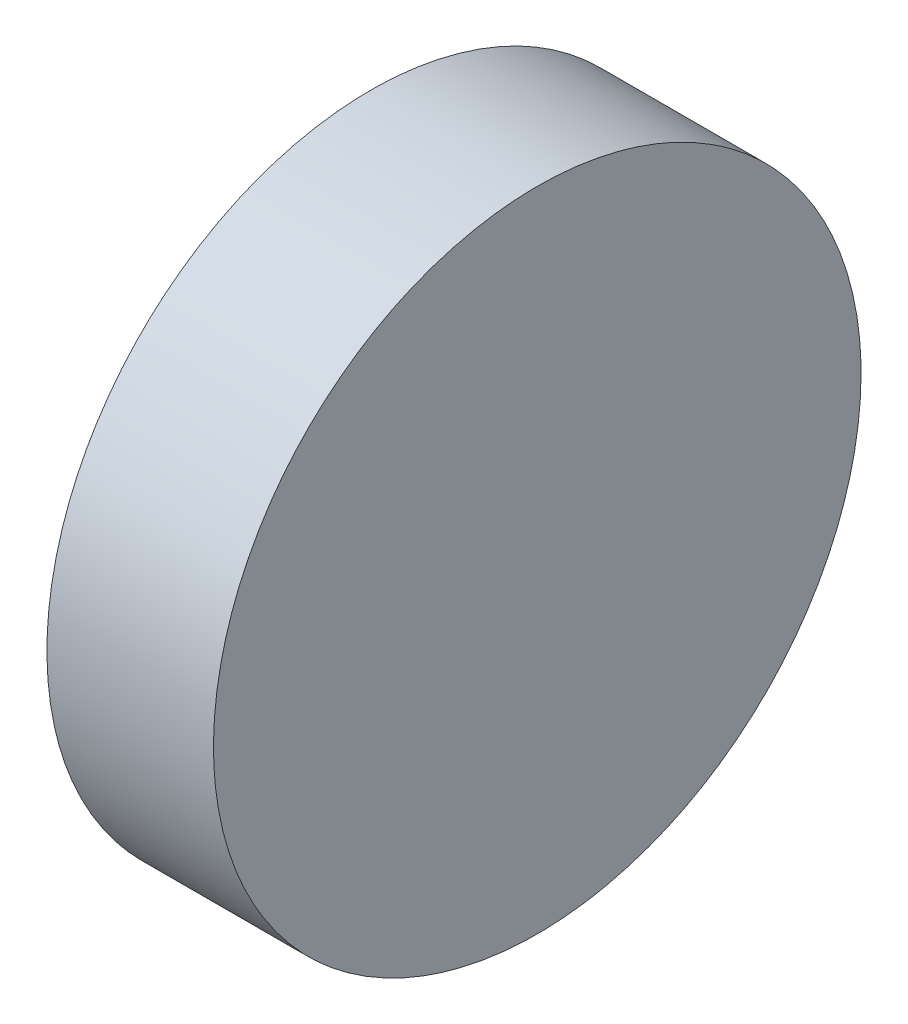
ISO-10303-21;
HEADER;
FILE_DESCRIPTION(('STEP AP214'),'2;1');
FILE_NAME('part.step','',(''),(''),'','','');
FILE_SCHEMA(('AUTOMOTIVE_DESIGN { 1 0 10303 214 1 1 1 1 }'));
ENDSEC;
DATA;
#1=APPLICATION_CONTEXT('core data for automotive mechanical design processes');
#2=APPLICATION_PROTOCOL_DEFINITION('international standard','automotive_design',2000,#1);
#3=PRODUCT_CONTEXT('',#1,'mechanical');
#4=PRODUCT('Part','Part','',(#3));
#5=PRODUCT_RELATED_PRODUCT_CATEGORY('part','',(#4));
#6=PRODUCT_DEFINITION_FORMATION('','',#4);
#7=PRODUCT_DEFINITION_CONTEXT('part definition',#1,'design');
#8=PRODUCT_DEFINITION('design','',#6,#7);
#9=PRODUCT_DEFINITION_SHAPE('','',#8);
#10=(LENGTH_UNIT() NAMED_UNIT(*) SI_UNIT(.MILLI.,.METRE.));
#11=(NAMED_UNIT(*) PLANE_ANGLE_UNIT() SI_UNIT($,.RADIAN.));
#12=(NAMED_UNIT(*) SI_UNIT($,.STERADIAN.) SOLID_ANGLE_UNIT());
#13=UNCERTAINTY_MEASURE_WITH_UNIT(LENGTH_MEASURE(1.E-05),#10,'distance_accuracy_value','');
#14=(GEOMETRIC_REPRESENTATION_CONTEXT(3) GLOBAL_UNCERTAINTY_ASSIGNED_CONTEXT((#13)) GLOBAL_UNIT_ASSIGNED_CONTEXT((#10,
#11,#12)) REPRESENTATION_CONTEXT('',''));
#15=CARTESIAN_POINT('',(0.,0.,0.));
#16=DIRECTION('',(0.,0.,1.));
#17=DIRECTION('',(1.,0.,0.));
#18=AXIS2_PLACEMENT_3D('',#15,#16,#17);
#19=CARTESIAN_POINT('',(24.3378726721836,36.,14.7146446609407));
#20=CARTESIAN_POINT('',(24.3378726721836,36.1682299792076,14.7146446609407));
#21=CARTESIAN_POINT('',(24.3378726721836,36.5046899376229,14.7815707077975));
#22=CARTESIAN_POINT('',(24.3378726721836,36.9325454072684,15.0674545927316));
#23=CARTESIAN_POINT('',(24.3378726721836,37.2184292922025,15.4953100623771));
#24=CARTESIAN_POINT('',(24.3378726721836,37.3188183624877,16.));
#25=CARTESIAN_POINT('',(24.3378726721836,37.2184292922025,16.5046899376229));
#26=CARTESIAN_POINT('',(24.3378726721836,36.9325454072684,16.9325454072684));
#27=CARTESIAN_POINT('',(24.3378726721836,36.5046899376229,17.2184292922025));
#28=CARTESIAN_POINT('',(24.3378726721836,36.,17.3188183624878));
#29=CARTESIAN_POINT('',(24.3378726721836,35.4953100623771,17.2184292922025));
#30=CARTESIAN_POINT('',(24.3378726721836,35.0674545927316,16.9325454072684));
#31=CARTESIAN_POINT('',(24.3378726721836,34.7815707077975,16.5046899376229));
#32=CARTESIAN_POINT('',(24.3378726721836,34.6811816375123,16.));
#33=CARTESIAN_POINT('',(24.3378726721836,34.7815707077975,15.4953100623771));
#34=CARTESIAN_POINT('',(24.3378726721836,35.0674545927316,15.0674545927316));
#35=CARTESIAN_POINT('',(24.3378726721836,35.4953100623771,14.7815707077975));
#36=CARTESIAN_POINT('',(24.3378726721836,35.8317700207924,14.7146446609407));
#37=CARTESIAN_POINT('',(24.3378726721836,36.,14.7146446609407));
#38=B_SPLINE_CURVE_WITH_KNOTS('',3,(#19,#20,#21,#22,#23,#24,#25,#26,#27,#28,#29,#30,#31,#32,#33,
#34,#35,#36,#37),.UNSPECIFIED.,.T.,.F.,(4,1,1,1,1,1,1,1,1,1,1,1,1,1,1,1,4),(0.,
0.0624999999999997,0.125,0.1875,0.25,0.3125,0.375,0.4375,0.5,0.5625,0.625,0.6875,0.75,0.8125,
0.875,0.9375,1.),.UNSPECIFIED.);
#39=DIRECTION('',(1.,0.,0.));
#40=VECTOR('',#39,1.);
#41=SURFACE_OF_LINEAR_EXTRUSION('',#38,#40);
#42=CARTESIAN_POINT('',(24.3378726721836,36.,14.7146446609407));
#43=CARTESIAN_POINT('',(24.3378726721836,36.0197921706209,14.7146446470269));
#44=CARTESIAN_POINT('',(24.3378726721836,36.0395839935619,14.7151078346916));
#45=CARTESIAN_POINT('',(24.3378726721836,36.0791259388407,14.7169521775189));
#46=CARTESIAN_POINT('',(24.3378726721836,36.0988760588795,14.718333382031));
#47=CARTESIAN_POINT('',(24.3378726721836,36.138292752249,14.7220054418346));
#48=CARTESIAN_POINT('',(24.3378726721836,36.1579593199991,14.7242963569526));
#49=CARTESIAN_POINT('',(24.3378726721836,36.1971673059562,14.7297795414951));
#50=CARTESIAN_POINT('',(24.3378726721836,36.2167087182843,14.7329718529476));
#51=CARTESIAN_POINT('',(24.3378726721836,36.2556247161304,14.7402495765758));
#52=CARTESIAN_POINT('',(24.3378726721836,36.2749992999462,14.744334997853));
#53=CARTESIAN_POINT('',(24.3378726721836,36.3135399912098,14.7533906635596));
#54=CARTESIAN_POINT('',(24.3378726721836,36.3327061048341,14.7583608816989));
#55=CARTESIAN_POINT('',(24.3378726721836,36.3707881375572,14.7691780063327));
#56=CARTESIAN_POINT('',(24.3378726721836,36.3897040714076,14.7750248608846));
#57=CARTESIAN_POINT('',(24.3378726721836,36.4272442489715,14.7875865909455));
#58=CARTESIAN_POINT('',(24.3378726721836,36.4458685114274,14.7943014104212));
#59=CARTESIAN_POINT('',(24.3378726721836,36.4827830263011,14.8085923322341));
#60=CARTESIAN_POINT('',(24.3378726721836,36.5010732893006,14.8161684072297));
#61=CARTESIAN_POINT('',(24.3378726721836,36.5372810008054,14.83216570329));
#62=CARTESIAN_POINT('',(24.3378726721836,36.5551984374598,14.8405869511704));
#63=CARTESIAN_POINT('',(24.3378726721836,36.5906258361186,14.8582493808133));
#64=CARTESIAN_POINT('',(24.3378726721836,36.6081357717545,14.8674906154502));
#65=CARTESIAN_POINT('',(24.3378726721836,36.6427126974179,14.8867698167363));
#66=CARTESIAN_POINT('',(24.3378726721836,36.6597796611473,14.8968078305452));
#67=CARTESIAN_POINT('',(24.3378726721836,36.6934353682858,14.9176568924794));
#68=CARTESIAN_POINT('',(24.3378726721836,36.7100240974723,14.928467963562));
#69=CARTESIAN_POINT('',(24.3378726721836,36.7426879898128,14.9508396002413));
#70=CARTESIAN_POINT('',(24.3378726721836,36.7587631581988,14.9624001581987));
#71=CARTESIAN_POINT('',(24.3378726721836,36.7903645930021,14.9862471998143));
#72=CARTESIAN_POINT('',(24.3378726721836,36.8058908849802,14.9985336495967));
#73=CARTESIAN_POINT('',(24.3378726721836,36.8363592155701,15.0238089005846));
#74=CARTESIAN_POINT('',(24.3378726721836,36.8513012925416,15.0367976555427));
#75=CARTESIAN_POINT('',(24.3378726721836,36.8805658883065,15.0634539672131));
#76=CARTESIAN_POINT('',(24.3378726721836,36.8948884403631,15.0771214873967));
#77=CARTESIAN_POINT('',(24.3378726721836,36.9228785126033,15.1051115596369));
#78=CARTESIAN_POINT('',(24.3378726721836,36.9365460327869,15.1194341116935));
#79=CARTESIAN_POINT('',(24.3378726721836,36.9632023444573,15.1486987074584));
#80=CARTESIAN_POINT('',(24.3378726721836,36.9761910994154,15.1636407844299));
#81=CARTESIAN_POINT('',(24.3378726721836,37.0014663504033,15.1941091150198));
#82=CARTESIAN_POINT('',(24.3378726721836,37.0137528001857,15.2096354069979));
#83=CARTESIAN_POINT('',(24.3378726721836,37.0375998418013,15.2412368418012));
#84=CARTESIAN_POINT('',(24.3378726721836,37.0491603997587,15.2573120101872));
#85=CARTESIAN_POINT('',(24.3378726721836,37.071532036438,15.2899759025277));
#86=CARTESIAN_POINT('',(24.3378726721836,37.0823431075206,15.3065646317142));
#87=CARTESIAN_POINT('',(24.3378726721836,37.1031921694548,15.3402203388527));
#88=CARTESIAN_POINT('',(24.3378726721836,37.1132301832637,15.357287302582));
#89=CARTESIAN_POINT('',(24.3378726721836,37.1325093845498,15.3918642282457));
#90=CARTESIAN_POINT('',(24.3378726721836,37.1417506191867,15.4093741638818));
#91=CARTESIAN_POINT('',(24.3378726721836,37.1594130488296,15.4448015625399));
#92=CARTESIAN_POINT('',(24.3378726721836,37.1678342967101,15.4627189991932));
#93=CARTESIAN_POINT('',(24.3378726721836,37.1838315927702,15.4989267107008));
#94=CARTESIAN_POINT('',(24.3378726721836,37.1914076677655,15.5172169737043));
#95=CARTESIAN_POINT('',(24.3378726721836,37.2056985895792,15.5541314885673));
#96=CARTESIAN_POINT('',(24.3378726721836,37.2124134090558,15.5727557510086));
#97=CARTESIAN_POINT('',(24.3378726721836,37.224975139114,15.6102959286123));
#98=CARTESIAN_POINT('',(24.3378726721836,37.2308219936622,15.6292118625171));
#99=CARTESIAN_POINT('',(24.3378726721836,37.2416391183063,15.6672938950916));
#100=CARTESIAN_POINT('',(24.3378726721836,37.2466093364596,15.6864600085129));
#101=CARTESIAN_POINT('',(24.3378726721836,37.2556650021278,15.7250007003311));
#102=CARTESIAN_POINT('',(24.3378726721836,37.2597504233525,15.7443752849046));
#103=CARTESIAN_POINT('',(24.3378726721836,37.2670281471242,15.7832912806807));
#104=CARTESIAN_POINT('',(24.3378726721836,37.2702204587727,15.8028326901811));
#105=CARTESIAN_POINT('',(24.3378726721836,37.2757036427797,15.8420406838634));
#106=CARTESIAN_POINT('',(24.3378726721836,37.2779945571663,15.8617072621656));
#107=CARTESIAN_POINT('',(24.3378726721836,37.2816666189681,15.9011239267069));
#108=CARTESIAN_POINT('',(24.3378726721836,37.2830478262096,15.9208740073685));
#109=CARTESIAN_POINT('',(24.3378726721836,37.2848921615801,15.9604160602261));
#110=CARTESIAN_POINT('',(24.3378726721836,37.2853553390593,15.9802080301131));
#111=CARTESIAN_POINT('',(24.3378726721836,37.2853553390593,16.019791969887));
#112=CARTESIAN_POINT('',(24.3378726721836,37.2848921615801,16.0395839397739));
#113=CARTESIAN_POINT('',(24.3378726721836,37.2830478262096,16.0791259926315));
#114=CARTESIAN_POINT('',(24.3378726721836,37.2816666189681,16.0988760732931));
#115=CARTESIAN_POINT('',(24.3378726721836,37.2779945571663,16.1382927378344));
#116=CARTESIAN_POINT('',(24.3378726721836,37.2757036427797,16.1579593161367));
#117=CARTESIAN_POINT('',(24.3378726721836,37.2702204587727,16.1971673098189));
#118=CARTESIAN_POINT('',(24.3378726721836,37.2670281471242,16.2167087193193));
#119=CARTESIAN_POINT('',(24.3378726721836,37.2597504233525,16.2556247150954));
#120=CARTESIAN_POINT('',(24.3378726721836,37.2556650021278,16.2749992996689));
#121=CARTESIAN_POINT('',(24.3378726721836,37.2466093364596,16.3135399914872));
#122=CARTESIAN_POINT('',(24.3378726721836,37.2416391183063,16.3327061049084));
#123=CARTESIAN_POINT('',(24.3378726721836,37.2308219936622,16.3707881374829));
#124=CARTESIAN_POINT('',(24.3378726721836,37.224975139114,16.3897040713877));
#125=CARTESIAN_POINT('',(24.3378726721836,37.2124134090558,16.4272442489914));
#126=CARTESIAN_POINT('',(24.3378726721836,37.2056985895792,16.4458685114328));
#127=CARTESIAN_POINT('',(24.3378726721836,37.1914076677656,16.4827830262958));
#128=CARTESIAN_POINT('',(24.3378726721836,37.1838315927702,16.5010732892992));
#129=CARTESIAN_POINT('',(24.3378726721836,37.1678342967101,16.5372810008068));
#130=CARTESIAN_POINT('',(24.3378726721836,37.1594130488296,16.5551984374601));
#131=CARTESIAN_POINT('',(24.3378726721836,37.1417506191867,16.5906258361182));
#132=CARTESIAN_POINT('',(24.3378726721836,37.1325093845498,16.6081357717544));
#133=CARTESIAN_POINT('',(24.3378726721836,37.1132301832637,16.642712697418));
#134=CARTESIAN_POINT('',(24.3378726721836,37.1031921694548,16.6597796611473));
#135=CARTESIAN_POINT('',(24.3378726721836,37.0823431075206,16.6934353682858));
#136=CARTESIAN_POINT('',(24.3378726721836,37.071532036438,16.7100240974723));
#137=CARTESIAN_POINT('',(24.3378726721836,37.0491603997587,16.7426879898128));
#138=CARTESIAN_POINT('',(24.3378726721836,37.0375998418013,16.7587631581988));
#139=CARTESIAN_POINT('',(24.3378726721836,37.0137528001857,16.7903645930021));
#140=CARTESIAN_POINT('',(24.3378726721836,37.0014663504033,16.8058908849802));
#141=CARTESIAN_POINT('',(24.3378726721836,36.9761910994154,16.8363592155701));
#142=CARTESIAN_POINT('',(24.3378726721836,36.9632023444573,16.8513012925416));
#143=CARTESIAN_POINT('',(24.3378726721836,36.9365460327869,16.8805658883065));
#144=CARTESIAN_POINT('',(24.3378726721836,36.9228785126033,16.8948884403631));
#145=CARTESIAN_POINT('',(24.3378726721836,36.8948884403631,16.9228785126033));
#146=CARTESIAN_POINT('',(24.3378726721836,36.8805658883065,16.9365460327869));
#147=CARTESIAN_POINT('',(24.3378726721836,36.8513012925416,16.9632023444573));
#148=CARTESIAN_POINT('',(24.3378726721836,36.8363592155701,16.9761910994155));
#149=CARTESIAN_POINT('',(24.3378726721836,36.8058908849802,17.0014663504033));
#150=CARTESIAN_POINT('',(24.3378726721836,36.7903645930021,17.0137528001857));
#151=CARTESIAN_POINT('',(24.3378726721836,36.7587631581988,17.0375998418013));
#152=CARTESIAN_POINT('',(24.3378726721836,36.7426879898128,17.0491603997587));
#153=CARTESIAN_POINT('',(24.3378726721836,36.7100240974723,17.071532036438));
#154=CARTESIAN_POINT('',(24.3378726721836,36.6934353682858,17.0823431075206));
#155=CARTESIAN_POINT('',(24.3378726721836,36.6597796611473,17.1031921694548));
#156=CARTESIAN_POINT('',(24.3378726721836,36.642712697418,17.1132301832637));
#157=CARTESIAN_POINT('',(24.3378726721836,36.6081357717544,17.1325093845498));
#158=CARTESIAN_POINT('',(24.3378726721836,36.5906258361182,17.1417506191867));
#159=CARTESIAN_POINT('',(24.3378726721836,36.5551984374601,17.1594130488296));
#160=CARTESIAN_POINT('',(24.3378726721836,36.5372810008068,17.1678342967101));
#161=CARTESIAN_POINT('',(24.3378726721836,36.5010732892992,17.1838315927702));
#162=CARTESIAN_POINT('',(24.3378726721836,36.4827830262957,17.1914076677656));
#163=CARTESIAN_POINT('',(24.3378726721836,36.4458685114327,17.2056985895792));
#164=CARTESIAN_POINT('',(24.3378726721836,36.4272442489914,17.2124134090559));
#165=CARTESIAN_POINT('',(24.3378726721836,36.3897040713877,17.224975139114));
#166=CARTESIAN_POINT('',(24.3378726721836,36.3707881374829,17.2308219936622));
#167=CARTESIAN_POINT('',(24.3378726721836,36.3327061049084,17.2416391183063));
#168=CARTESIAN_POINT('',(24.3378726721836,36.3135399914871,17.2466093364596));
#169=CARTESIAN_POINT('',(24.3378726721836,36.2749992996689,17.2556650021278));
#170=CARTESIAN_POINT('',(24.3378726721836,36.2556247150954,17.2597504233525));
#171=CARTESIAN_POINT('',(24.3378726721836,36.2167087193193,17.2670281471242));
#172=CARTESIAN_POINT('',(24.3378726721836,36.1971673098189,17.2702204587727));
#173=CARTESIAN_POINT('',(24.3378726721836,36.1579593161366,17.2757036427797));
#174=CARTESIAN_POINT('',(24.3378726721836,36.1382927378344,17.2779945571663));
#175=CARTESIAN_POINT('',(24.3378726721836,36.0988760732931,17.2816666189681));
#176=CARTESIAN_POINT('',(24.3378726721836,36.0791259926315,17.2830478262096));
#177=CARTESIAN_POINT('',(24.3378726721836,36.0395839397739,17.2848921615801));
#178=CARTESIAN_POINT('',(24.3378726721836,36.019791969887,17.2853553390593));
#179=CARTESIAN_POINT('',(24.3378726721836,35.980208030113,17.2853553390593));
#180=CARTESIAN_POINT('',(24.3378726721836,35.9604160602261,17.2848921615801));
#181=CARTESIAN_POINT('',(24.3378726721836,35.9208740073685,17.2830478262096));
#182=CARTESIAN_POINT('',(24.3378726721836,35.9011239267069,17.2816666189681));
#183=CARTESIAN_POINT('',(24.3378726721836,35.8617072621656,17.2779945571663));
#184=CARTESIAN_POINT('',(24.3378726721836,35.8420406838634,17.2757036427797));
#185=CARTESIAN_POINT('',(24.3378726721836,35.8028326901811,17.2702204587727));
#186=CARTESIAN_POINT('',(24.3378726721836,35.7832912806807,17.2670281471242));
#187=CARTESIAN_POINT('',(24.3378726721836,35.7443752849046,17.2597504233525));
#188=CARTESIAN_POINT('',(24.3378726721836,35.7250007003311,17.2556650021278));
#189=CARTESIAN_POINT('',(24.3378726721836,35.6864600085129,17.2466093364596));
#190=CARTESIAN_POINT('',(24.3378726721836,35.6672938950916,17.2416391183063));
#191=CARTESIAN_POINT('',(24.3378726721836,35.6292118625171,17.2308219936622));
#192=CARTESIAN_POINT('',(24.3378726721836,35.6102959286123,17.224975139114));
#193=CARTESIAN_POINT('',(24.3378726721836,35.5727557510086,17.2124134090558));
#194=CARTESIAN_POINT('',(24.3378726721836,35.5541314885672,17.2056985895792));
#195=CARTESIAN_POINT('',(24.3378726721836,35.5172169737042,17.1914076677656));
#196=CARTESIAN_POINT('',(24.3378726721836,35.4989267107008,17.1838315927702));
#197=CARTESIAN_POINT('',(24.3378726721836,35.4627189991932,17.1678342967101));
#198=CARTESIAN_POINT('',(24.3378726721836,35.4448015625399,17.1594130488296));
#199=CARTESIAN_POINT('',(24.3378726721836,35.4093741638818,17.1417506191867));
#200=CARTESIAN_POINT('',(24.3378726721836,35.3918642282456,17.1325093845498));
#201=CARTESIAN_POINT('',(24.3378726721836,35.357287302582,17.1132301832637));
#202=CARTESIAN_POINT('',(24.3378726721836,35.3402203388527,17.1031921694548));
#203=CARTESIAN_POINT('',(24.3378726721836,35.3065646317142,17.0823431075206));
#204=CARTESIAN_POINT('',(24.3378726721836,35.2899759025277,17.071532036438));
#205=CARTESIAN_POINT('',(24.3378726721836,35.2573120101872,17.0491603997587));
#206=CARTESIAN_POINT('',(24.3378726721836,35.2412368418012,17.0375998418013));
#207=CARTESIAN_POINT('',(24.3378726721836,35.2096354069979,17.0137528001857));
#208=CARTESIAN_POINT('',(24.3378726721836,35.1941091150198,17.0014663504033));
#209=CARTESIAN_POINT('',(24.3378726721836,35.1636407844299,16.9761910994155));
#210=CARTESIAN_POINT('',(24.3378726721836,35.1486987074584,16.9632023444573));
#211=CARTESIAN_POINT('',(24.3378726721836,35.1194341116935,16.9365460327869));
#212=CARTESIAN_POINT('',(24.3378726721836,35.1051115596369,16.9228785126033));
#213=CARTESIAN_POINT('',(24.3378726721836,35.0771214873967,16.8948884403631));
#214=CARTESIAN_POINT('',(24.3378726721836,35.0634539672131,16.8805658883065));
#215=CARTESIAN_POINT('',(24.3378726721836,35.0367976555427,16.8513012925416));
#216=CARTESIAN_POINT('',(24.3378726721836,35.0238089005845,16.8363592155701));
#217=CARTESIAN_POINT('',(24.3378726721836,34.9985336495967,16.8058908849802));
#218=CARTESIAN_POINT('',(24.3378726721836,34.9862471998143,16.7903645930021));
#219=CARTESIAN_POINT('',(24.3378726721836,34.9624001581987,16.7587631581988));
#220=CARTESIAN_POINT('',(24.3378726721836,34.9508396002413,16.7426879898128));
#221=CARTESIAN_POINT('',(24.3378726721836,34.928467963562,16.7100240974723));
#222=CARTESIAN_POINT('',(24.3378726721836,34.9176568924794,16.6934353682858));
#223=CARTESIAN_POINT('',(24.3378726721836,34.8968078305452,16.6597796611473));
#224=CARTESIAN_POINT('',(24.3378726721836,34.8867698167363,16.642712697418));
#225=CARTESIAN_POINT('',(24.3378726721836,34.8674906154502,16.6081357717544));
#226=CARTESIAN_POINT('',(24.3378726721836,34.8582493808133,16.5906258361182));
#227=CARTESIAN_POINT('',(24.3378726721836,34.8405869511704,16.5551984374601));
#228=CARTESIAN_POINT('',(24.3378726721836,34.8321657032899,16.5372810008068));
#229=CARTESIAN_POINT('',(24.3378726721836,34.8161684072298,16.5010732892992));
#230=CARTESIAN_POINT('',(24.3378726721836,34.8085923322344,16.4827830262958));
#231=CARTESIAN_POINT('',(24.3378726721836,34.7943014104208,16.4458685114328));
#232=CARTESIAN_POINT('',(24.3378726721836,34.7875865909442,16.4272442489914));
#233=CARTESIAN_POINT('',(24.3378726721836,34.775024860886,16.3897040713877));
#234=CARTESIAN_POINT('',(24.3378726721836,34.7691780063378,16.3707881374829));
#235=CARTESIAN_POINT('',(24.3378726721836,34.7583608816937,16.3327061049084));
#236=CARTESIAN_POINT('',(24.3378726721836,34.7533906635404,16.3135399914872));
#237=CARTESIAN_POINT('',(24.3378726721836,34.7443349978722,16.2749992996689));
#238=CARTESIAN_POINT('',(24.3378726721836,34.7402495766475,16.2556247150954));
#239=CARTESIAN_POINT('',(24.3378726721836,34.7329718528758,16.2167087193193));
#240=CARTESIAN_POINT('',(24.3378726721836,34.7297795412273,16.1971673098189));
#241=CARTESIAN_POINT('',(24.3378726721836,34.7242963572203,16.1579593161367));
#242=CARTESIAN_POINT('',(24.3378726721836,34.7220054428337,16.1382927378344));
#243=CARTESIAN_POINT('',(24.3378726721836,34.7183333810319,16.0988760732931));
#244=CARTESIAN_POINT('',(24.3378726721836,34.7169521737904,16.0791259926315));
#245=CARTESIAN_POINT('',(24.3378726721836,34.7151078384199,16.0395839397739));
#246=CARTESIAN_POINT('',(24.3378726721836,34.7146446609407,16.019791969887));
#247=CARTESIAN_POINT('',(24.3378726721836,34.7146446609407,15.980208030113));
#248=CARTESIAN_POINT('',(24.3378726721836,34.7151078384199,15.9604160602261));
#249=CARTESIAN_POINT('',(24.3378726721836,34.7169521737904,15.9208740073685));
#250=CARTESIAN_POINT('',(24.3378726721836,34.7183333810319,15.9011239267069));
#251=CARTESIAN_POINT('',(24.3378726721836,34.7220054428337,15.8617072621656));
#252=CARTESIAN_POINT('',(24.3378726721836,34.7242963572203,15.8420406838633));
#253=CARTESIAN_POINT('',(24.3378726721836,34.7297795412273,15.8028326901811));
#254=CARTESIAN_POINT('',(24.3378726721836,34.7329718528758,15.7832912806807));
#255=CARTESIAN_POINT('',(24.3378726721836,34.7402495766475,15.7443752849046));
#256=CARTESIAN_POINT('',(24.3378726721836,34.7443349978722,15.7250007003311));
#257=CARTESIAN_POINT('',(24.3378726721836,34.7533906635404,15.6864600085129));
#258=CARTESIAN_POINT('',(24.3378726721836,34.7583608816937,15.6672938950916));
#259=CARTESIAN_POINT('',(24.3378726721836,34.7691780063378,15.6292118625171));
#260=CARTESIAN_POINT('',(24.3378726721836,34.775024860886,15.6102959286123));
#261=CARTESIAN_POINT('',(24.3378726721836,34.7875865909442,15.5727557510086));
#262=CARTESIAN_POINT('',(24.3378726721836,34.7943014104208,15.5541314885672));
#263=CARTESIAN_POINT('',(24.3378726721836,34.8085923322344,15.5172169737042));
#264=CARTESIAN_POINT('',(24.3378726721836,34.8161684072298,15.4989267107008));
#265=CARTESIAN_POINT('',(24.3378726721836,34.8321657032899,15.4627189991932));
#266=CARTESIAN_POINT('',(24.3378726721836,34.8405869511704,15.4448015625399));
#267=CARTESIAN_POINT('',(24.3378726721836,34.8582493808133,15.4093741638818));
#268=CARTESIAN_POINT('',(24.3378726721836,34.8674906154502,15.3918642282456));
#269=CARTESIAN_POINT('',(24.3378726721836,34.8867698167363,15.357287302582));
#270=CARTESIAN_POINT('',(24.3378726721836,34.8968078305452,15.3402203388527));
#271=CARTESIAN_POINT('',(24.3378726721836,34.9176568924794,15.3065646317142));
#272=CARTESIAN_POINT('',(24.3378726721836,34.928467963562,15.2899759025277));
#273=CARTESIAN_POINT('',(24.3378726721836,34.9508396002413,15.2573120101872));
#274=CARTESIAN_POINT('',(24.3378726721836,34.9624001581987,15.2412368418012));
#275=CARTESIAN_POINT('',(24.3378726721836,34.9862471998143,15.2096354069979));
#276=CARTESIAN_POINT('',(24.3378726721836,34.9985336495967,15.1941091150198));
#277=CARTESIAN_POINT('',(24.3378726721836,35.0238089005846,15.1636407844299));
#278=CARTESIAN_POINT('',(24.3378726721836,35.0367976555427,15.1486987074584));
#279=CARTESIAN_POINT('',(24.3378726721836,35.0634539672131,15.1194341116935));
#280=CARTESIAN_POINT('',(24.3378726721836,35.0771214873967,15.1051115596369));
#281=CARTESIAN_POINT('',(24.3378726721836,35.1051115596369,15.0771214873967));
#282=CARTESIAN_POINT('',(24.3378726721836,35.1194341116935,15.0634539672131));
#283=CARTESIAN_POINT('',(24.3378726721836,35.1486987074584,15.0367976555427));
#284=CARTESIAN_POINT('',(24.3378726721836,35.1636407844299,15.0238089005846));
#285=CARTESIAN_POINT('',(24.3378726721836,35.1941091150198,14.9985336495967));
#286=CARTESIAN_POINT('',(24.3378726721836,35.2096354069979,14.9862471998143));
#287=CARTESIAN_POINT('',(24.3378726721836,35.2412368418012,14.9624001581987));
#288=CARTESIAN_POINT('',(24.3378726721836,35.2573120101872,14.9508396002413));
#289=CARTESIAN_POINT('',(24.3378726721836,35.2899759025277,14.928467963562));
#290=CARTESIAN_POINT('',(24.3378726721836,35.3065646317142,14.9176568924794));
#291=CARTESIAN_POINT('',(24.3378726721836,35.3402203388527,14.8968078305452));
#292=CARTESIAN_POINT('',(24.3378726721836,35.3572873025821,14.8867698167363));
#293=CARTESIAN_POINT('',(24.3378726721836,35.3918642282456,14.8674906154502));
#294=CARTESIAN_POINT('',(24.3378726721836,35.4093741638815,14.8582493808133));
#295=CARTESIAN_POINT('',(24.3378726721836,35.4448015625403,14.8405869511704));
#296=CARTESIAN_POINT('',(24.3378726721836,35.4627189991946,14.83216570329));
#297=CARTESIAN_POINT('',(24.3378726721836,35.4989267106994,14.8161684072297));
#298=CARTESIAN_POINT('',(24.3378726721836,35.5172169736989,14.8085923322341));
#299=CARTESIAN_POINT('',(24.3378726721836,35.5541314885726,14.7943014104212));
#300=CARTESIAN_POINT('',(24.3378726721836,35.5727557510286,14.7875865909455));
#301=CARTESIAN_POINT('',(24.3378726721836,35.6102959285924,14.7750248608846));
#302=CARTESIAN_POINT('',(24.3378726721836,35.6292118624428,14.7691780063327));
#303=CARTESIAN_POINT('',(24.3378726721836,35.6672938951659,14.7583608816989));
#304=CARTESIAN_POINT('',(24.3378726721836,35.6864600087902,14.7533906635596));
#305=CARTESIAN_POINT('',(24.3378726721836,35.7250007000538,14.744334997853));
#306=CARTESIAN_POINT('',(24.3378726721836,35.7443752838696,14.7402495765758));
#307=CARTESIAN_POINT('',(24.3378726721836,35.7832912817157,14.7329718529475));
#308=CARTESIAN_POINT('',(24.3378726721836,35.8028326940438,14.7297795414951));
#309=CARTESIAN_POINT('',(24.3378726721836,35.8420406800009,14.7242963569526));
#310=CARTESIAN_POINT('',(24.3378726721836,35.861707247751,14.7220054418346));
#311=CARTESIAN_POINT('',(24.3378726721836,35.9011239411206,14.718333382031));
#312=CARTESIAN_POINT('',(24.3378726721836,35.9208740611593,14.7169521775189));
#313=CARTESIAN_POINT('',(24.3378726721836,35.9604160064381,14.7151078346916));
#314=CARTESIAN_POINT('',(24.3378726721836,35.9802078293791,14.7146446470269));
#315=CARTESIAN_POINT('',(24.3378726721836,36.,14.7146446609407));
#316=B_SPLINE_CURVE_WITH_KNOTS('',3,(#42,#43,#44,#45,#46,#47,#48,#49,#50,#51,#52,#53,#54,#55,
#56,#57,#58,#59,#60,#61,#62,#63,#64,#65,#66,#67,#68,#69,#70,#71,#72,#73,#74,#75,#76,#77,#78,#79,
#80,#81,#82,#83,#84,#85,#86,#87,#88,#89,#90,#91,#92,#93,#94,#95,#96,#97,#98,#99,#100,#101,#102,
#103,#104,#105,#106,#107,#108,#109,#110,#111,#112,#113,#114,#115,#116,#117,#118,#119,#120,#121,
#122,#123,#124,#125,#126,#127,#128,#129,#130,#131,#132,#133,#134,#135,#136,#137,#138,#139,#140,
#141,#142,#143,#144,#145,#146,#147,#148,#149,#150,#151,#152,#153,#154,#155,#156,#157,#158,#159,
#160,#161,#162,#163,#164,#165,#166,#167,#168,#169,#170,#171,#172,#173,#174,#175,#176,#177,#178,
#179,#180,#181,#182,#183,#184,#185,#186,#187,#188,#189,#190,#191,#192,#193,#194,#195,#196,#197,
#198,#199,#200,#201,#202,#203,#204,#205,#206,#207,#208,#209,#210,#211,#212,#213,#214,#215,#216,
#217,#218,#219,#220,#221,#222,#223,#224,#225,#226,#227,#228,#229,#230,#231,#232,#233,#234,#235,
#236,#237,#238,#239,#240,#241,#242,#243,#244,#245,#246,#247,#248,#249,#250,#251,#252,#253,#254,
#255,#256,#257,#258,#259,#260,#261,#262,#263,#264,#265,#266,#267,#268,#269,#270,#271,#272,#273,
#274,#275,#276,#277,#278,#279,#280,#281,#282,#283,#284,#285,#286,#287,#288,#289,#290,#291,#292,
#293,#294,#295,#296,#297,#298,#299,#300,#301,#302,#303,#304,#305,#306,#307,#308,#309,#310,#311,
#312,#313,#314,#315),.UNSPECIFIED.,.F.,.F.,(4,2,2,2,2,2,2,2,2,2,2,2,2,2,2,2,2,2,2,2,2,2,2,2,2,2,
2,2,2,2,2,2,2,2,2,2,2,2,2,2,2,2,2,2,2,2,2,2,2,2,2,2,2,2,2,2,2,2,2,2,2,2,2,2,2,2,2,2,2,2,2,2,2,2,
2,2,2,2,2,2,2,2,2,2,2,2,2,2,2,2,2,2,2,2,2,2,2,2,2,2,2,2,2,2,2,2,2,2,2,2,2,2,2,2,2,2,2,2,2,2,2,2,
2,2,2,2,2,2,2,2,2,2,2,2,2,2,4),(0.,0.0593705991087962,0.11874439003625,0.178122086282982,
0.237502551496683,0.296883621869496,0.356262928129227,0.415638717424668,0.475010675504052,
0.534380749279072,0.593752707358478,0.653128496653899,0.712507802913644,0.771888873286448,
0.831269338500155,0.890647034746885,0.950020825674333,1.00939142478313,1.06876202389191,
1.12813581481936,1.1875135110661,1.24689397627981,1.30627504665261,1.36565435291235,
1.42503014220779,1.48440210028717,1.5437721740622,1.60314413214159,1.66251992143702,
1.72189922769676,1.78128029806956,1.84066076328327,1.90003845953001,1.95941225045746,
2.01878284956624,2.07815344867503,2.13752723960248,2.19690493584922,2.25628540106293,
2.31566647143573,2.37504577769547,2.4344215669909,2.49379352507029,2.55316359884532,
2.61253555692471,2.67191134622014,2.73129065247988,2.79067172285269,2.85005218806639,
2.90942988431313,2.96880367524058,3.02817427434937,3.08754487345815,3.1469186643856,
3.20629636063233,3.26567682584605,3.32505789621885,3.38443720247858,3.44381299177402,
3.50318494985341,3.56255502362843,3.62192698170783,3.68130277100325,3.740682077263,
3.80006314763579,3.85944361284951,3.91882130909625,3.97819510002369,4.03756569913247,
4.09693629824126,4.15631008916872,4.21568778541545,4.27506825062917,4.33444932100196,
4.39382862726171,4.45320441655714,4.51257637463652,4.57194644841156,4.63131840649095,
4.69069419578638,4.75007350204612,4.80945457241892,4.86883503763263,4.92821273387936,
4.98758652480681,5.0469571239156,5.10632772302439,5.16570151395183,5.22507921019857,
5.28445967541228,5.34384074578508,5.40322005204482,5.46259584134026,5.52196779941964,
5.58133787319468,5.64070983127406,5.70008562056949,5.75946492682923,5.81884599720203,
5.87822646241574,5.93760415866248,5.99697794958992,6.05634854869872,6.11571914780751,
6.17509293873495,6.23447063498169,6.2938511001954,6.3532321705682,6.41261147682794,
6.47198726612337,6.53135922420276,6.59072929797779,6.65010125605717,6.70947704535261,
6.76885635161235,6.82823742198515,6.88761788719887,6.9469955834456,7.00636937437305,
7.06573997348183,7.12511057259062,7.18448436351807,7.24386205976481,7.30324252497851,
7.36262359535132,7.42200290161106,7.48137869090649,7.54075064898587,7.6001207227609,
7.6594926808403,7.71886847013573,7.77824777639547,7.83762884676825,7.89700931198197,
7.95638700822871,8.01576079915615,8.07513139826494),.UNSPECIFIED.);
#317=CARTESIAN_POINT('',(24.3378726721836,36.,14.7146446609407));
#318=VERTEX_POINT('',#317);
#319=EDGE_CURVE('E10',#318,#318,#316,.T.);
#320=ORIENTED_EDGE('',*,*,#319,.T.);
#321=EDGE_LOOP('',(#320));
#322=FACE_BOUND('',#321,.T.);
#323=CARTESIAN_POINT('',(24.999,36.,14.7146446609407));
#324=CARTESIAN_POINT('',(24.999,35.9831767599685,14.7146446508393));
#325=CARTESIAN_POINT('',(24.999,35.9663537079869,14.7149792999934));
#326=CARTESIAN_POINT('',(24.999,35.9327332138723,14.7163127366982));
#327=CARTESIAN_POINT('',(24.999,35.9159357728383,14.7173115519876));
#328=CARTESIAN_POINT('',(24.999,35.8823921944051,14.7199682151912));
#329=CARTESIAN_POINT('',(24.999,35.8656460599646,14.7216261004176));
#330=CARTESIAN_POINT('',(24.999,35.8322306558245,14.7255958030042));
#331=CARTESIAN_POINT('',(24.999,35.8155613899934,14.7279076529193));
#332=CARTESIAN_POINT('',(24.999,35.7823253215178,14.7331802023157));
#333=CARTESIAN_POINT('',(24.999,35.7657585218077,14.7361409202913));
#334=CARTESIAN_POINT('',(24.999,35.7327529767351,14.7427061314859));
#335=CARTESIAN_POINT('',(24.999,35.7163142313727,14.7463106247049));
#336=CARTESIAN_POINT('',(24.999,35.6835903915808,14.7541583164638));
#337=CARTESIAN_POINT('',(24.999,35.6673052927848,14.7584014967944));
#338=CARTESIAN_POINT('',(24.999,35.634914341728,14.7675214933347));
#339=CARTESIAN_POINT('',(24.999,35.6188084805834,14.7723982779871));
#340=CARTESIAN_POINT('',(24.999,35.5868016078726,14.7827804056497));
#341=CARTESIAN_POINT('',(24.999,35.5709005847597,14.7882857130561));
#342=CARTESIAN_POINT('',(24.999,35.5393289625561,14.7999198115305));
#343=CARTESIAN_POINT('',(24.999,35.5236583538693,14.8060485765486));
#344=CARTESIAN_POINT('',(24.999,35.4925732602107,14.8189244439294));
#345=CARTESIAN_POINT('',(24.999,35.4771587752388,14.8256715462921));
#346=CARTESIAN_POINT('',(24.999,35.4466077171605,14.8397695045223));
#347=CARTESIAN_POINT('',(24.999,35.4314711556886,14.8471203855953));
#348=CARTESIAN_POINT('',(24.999,35.4014976060805,14.8624113894559));
#349=CARTESIAN_POINT('',(24.999,35.3866606349553,14.8703515455839));
#350=CARTESIAN_POINT('',(24.999,35.3573079624021,14.8868065953438));
#351=CARTESIAN_POINT('',(24.999,35.3427922770068,14.8953215175719));
#352=CARTESIAN_POINT('',(24.999,35.3141038719756,14.9129116104738));
#353=CARTESIAN_POINT('',(24.999,35.2999311621282,14.921986797111));
#354=CARTESIAN_POINT('',(24.999,35.2719504118425,14.9406829367248));
#355=CARTESIAN_POINT('',(24.999,35.2581423714044,14.9503038897014));
#356=CARTESIAN_POINT('',(24.999,35.230912667291,14.9700770828028));
#357=CARTESIAN_POINT('',(24.999,35.2174909926132,14.9802293077753));
#358=CARTESIAN_POINT('',(24.999,35.1910557274519,15.0010505662499));
#359=CARTESIAN_POINT('',(24.999,35.1780421166841,15.0117195739964));
#360=CARTESIAN_POINT('',(24.999,35.1524446903416,15.0335599091542));
#361=CARTESIAN_POINT('',(24.999,35.1398608504741,15.0447312080908));
#362=CARTESIAN_POINT('',(24.999,35.1151446516472,15.0675616503012));
#363=CARTESIAN_POINT('',(24.999,35.1030122738533,15.0792207731803));
#364=CARTESIAN_POINT('',(24.999,35.0792207731803,15.1030122738533));
#365=CARTESIAN_POINT('',(24.999,35.0675616503012,15.1151446516472));
#366=CARTESIAN_POINT('',(24.999,35.0447312080908,15.1398608504741));
#367=CARTESIAN_POINT('',(24.999,35.0335599091542,15.1524446903416));
#368=CARTESIAN_POINT('',(24.999,35.0117195739964,15.1780421166841));
#369=CARTESIAN_POINT('',(24.999,35.0010505662499,15.1910557274518));
#370=CARTESIAN_POINT('',(24.999,34.9802293077753,15.2174909926132));
#371=CARTESIAN_POINT('',(24.999,34.9700770828027,15.230912667291));
#372=CARTESIAN_POINT('',(24.999,34.9503038897014,15.2581423714044));
#373=CARTESIAN_POINT('',(24.999,34.9406829367248,15.2719504118425));
#374=CARTESIAN_POINT('',(24.999,34.921986797111,15.2999311621281));
#375=CARTESIAN_POINT('',(24.999,34.9129116104738,15.3141038719756));
#376=CARTESIAN_POINT('',(24.999,34.8953215175719,15.3427922770067));
#377=CARTESIAN_POINT('',(24.999,34.8868065953438,15.3573079624021));
#378=CARTESIAN_POINT('',(24.999,34.8703515455839,15.3866606349553));
#379=CARTESIAN_POINT('',(24.999,34.8624113894559,15.4014976060806));
#380=CARTESIAN_POINT('',(24.999,34.8471203855953,15.4314711556886));
#381=CARTESIAN_POINT('',(24.999,34.8397695045223,15.4466077171605));
#382=CARTESIAN_POINT('',(24.999,34.8256715462921,15.4771587752389));
#383=CARTESIAN_POINT('',(24.999,34.8189244439294,15.4925732602109));
#384=CARTESIAN_POINT('',(24.999,34.8060485765485,15.5236583538691));
#385=CARTESIAN_POINT('',(24.999,34.7999198115304,15.5393289625553));
#386=CARTESIAN_POINT('',(24.999,34.7882857130562,15.5709005847604));
#387=CARTESIAN_POINT('',(24.999,34.7827804056499,15.5868016078754));
#388=CARTESIAN_POINT('',(24.999,34.7723982779868,15.6188084805805));
#389=CARTESIAN_POINT('',(24.999,34.7675214933337,15.6349143417172));
#390=CARTESIAN_POINT('',(24.999,34.7584014967954,15.6673052927955));
#391=CARTESIAN_POINT('',(24.999,34.7541583164675,15.683590391621));
#392=CARTESIAN_POINT('',(24.999,34.7463106247012,15.7163142313325));
#393=CARTESIAN_POINT('',(24.999,34.742706131472,15.7327529765851));
#394=CARTESIAN_POINT('',(24.999,34.7361409203053,15.7657585219577));
#395=CARTESIAN_POINT('',(24.999,34.7331802023678,15.7823253220776));
#396=CARTESIAN_POINT('',(24.999,34.7279076528672,15.8155613894336));
#397=CARTESIAN_POINT('',(24.999,34.7255958028099,15.8322306537353));
#398=CARTESIAN_POINT('',(24.999,34.721626100612,15.8656460620536));
#399=CARTESIAN_POINT('',(24.999,34.7199682159165,15.8823922022013));
#400=CARTESIAN_POINT('',(24.999,34.7173115512623,15.9159357650425));
#401=CARTESIAN_POINT('',(24.999,34.7163127339914,15.9327331847789));
#402=CARTESIAN_POINT('',(24.999,34.7149793027001,15.966353737079));
#403=CARTESIAN_POINT('',(24.999,34.7146446609407,15.9831768685395));
#404=CARTESIAN_POINT('',(24.999,34.7146446609407,16.0168231314605));
#405=CARTESIAN_POINT('',(24.999,34.7149793027001,16.033646262921));
#406=CARTESIAN_POINT('',(24.999,34.7163127339914,16.0672668152211));
#407=CARTESIAN_POINT('',(24.999,34.7173115512623,16.0840642349575));
#408=CARTESIAN_POINT('',(24.999,34.7199682159165,16.1176077977987));
#409=CARTESIAN_POINT('',(24.999,34.721626100612,16.1343539379464));
#410=CARTESIAN_POINT('',(24.999,34.7255958028099,16.1677693462647));
#411=CARTESIAN_POINT('',(24.999,34.7279076528672,16.1844386105664));
#412=CARTESIAN_POINT('',(24.999,34.7331802023678,16.2176746779224));
#413=CARTESIAN_POINT('',(24.999,34.7361409203053,16.2342414780423));
#414=CARTESIAN_POINT('',(24.999,34.742706131472,16.2672470234149));
#415=CARTESIAN_POINT('',(24.999,34.7463106247012,16.2836857686675));
#416=CARTESIAN_POINT('',(24.999,34.7541583164676,16.316409608379));
#417=CARTESIAN_POINT('',(24.999,34.7584014967954,16.3326947072045));
#418=CARTESIAN_POINT('',(24.999,34.7675214933337,16.3650856582828));
#419=CARTESIAN_POINT('',(24.999,34.7723982779868,16.3811915194195));
#420=CARTESIAN_POINT('',(24.999,34.7827804056499,16.4131983921246));
#421=CARTESIAN_POINT('',(24.999,34.7882857130562,16.4290994152396));
#422=CARTESIAN_POINT('',(24.999,34.7999198115304,16.4606710374447));
#423=CARTESIAN_POINT('',(24.999,34.8060485765485,16.4763416461309));
#424=CARTESIAN_POINT('',(24.999,34.8189244439294,16.5074267397891));
#425=CARTESIAN_POINT('',(24.999,34.8256715462921,16.5228412247611));
#426=CARTESIAN_POINT('',(24.999,34.8397695045223,16.5533922828395));
#427=CARTESIAN_POINT('',(24.999,34.8471203855953,16.5685288443114));
#428=CARTESIAN_POINT('',(24.999,34.8624113894559,16.5985023939194));
#429=CARTESIAN_POINT('',(24.999,34.8703515455839,16.6133393650447));
#430=CARTESIAN_POINT('',(24.999,34.8868065953438,16.6426920375979));
#431=CARTESIAN_POINT('',(24.999,34.8953215175719,16.6572077229933));
#432=CARTESIAN_POINT('',(24.999,34.9129116104738,16.6858961280244));
#433=CARTESIAN_POINT('',(24.999,34.921986797111,16.7000688378719));
#434=CARTESIAN_POINT('',(24.999,34.9406829367248,16.7280495881575));
#435=CARTESIAN_POINT('',(24.999,34.9503038897014,16.7418576285956));
#436=CARTESIAN_POINT('',(24.999,34.9700770828028,16.769087332709));
#437=CARTESIAN_POINT('',(24.999,34.9802293077753,16.7825090073868));
#438=CARTESIAN_POINT('',(24.999,35.0010505662499,16.8089442725482));
#439=CARTESIAN_POINT('',(24.999,35.0117195739963,16.8219578833159));
#440=CARTESIAN_POINT('',(24.999,35.0335599091542,16.8475553096584));
#441=CARTESIAN_POINT('',(24.999,35.0447312080908,16.8601391495259));
#442=CARTESIAN_POINT('',(24.999,35.0675616503012,16.8848553483528));
#443=CARTESIAN_POINT('',(24.999,35.0792207731803,16.8969877261467));
#444=CARTESIAN_POINT('',(24.999,35.1030122738533,16.9207792268197));
#445=CARTESIAN_POINT('',(24.999,35.1151446516472,16.9324383496989));
#446=CARTESIAN_POINT('',(24.999,35.1398608504741,16.9552687919092));
#447=CARTESIAN_POINT('',(24.999,35.1524446903416,16.9664400908458));
#448=CARTESIAN_POINT('',(24.999,35.1780421166841,16.9882804260037));
#449=CARTESIAN_POINT('',(24.999,35.1910557274518,16.9989494337501));
#450=CARTESIAN_POINT('',(24.999,35.2174909926132,17.0197706922247));
#451=CARTESIAN_POINT('',(24.999,35.230912667291,17.0299229171973));
#452=CARTESIAN_POINT('',(24.999,35.2581423714044,17.0496961102986));
#453=CARTESIAN_POINT('',(24.999,35.2719504118425,17.0593170632752));
#454=CARTESIAN_POINT('',(24.999,35.2999311621281,17.078013202889));
#455=CARTESIAN_POINT('',(24.999,35.3141038719756,17.0870883895262));
#456=CARTESIAN_POINT('',(24.999,35.3427922770067,17.1046784824281));
#457=CARTESIAN_POINT('',(24.999,35.3573079624021,17.1131934046562));
#458=CARTESIAN_POINT('',(24.999,35.3866606349553,17.1296484544161));
#459=CARTESIAN_POINT('',(24.999,35.4014976060806,17.1375886105441));
#460=CARTESIAN_POINT('',(24.999,35.4314711556886,17.1528796144047));
#461=CARTESIAN_POINT('',(24.999,35.4466077171605,17.1602304954777));
#462=CARTESIAN_POINT('',(24.999,35.4771587752389,17.1743284537079));
#463=CARTESIAN_POINT('',(24.999,35.4925732602109,17.1810755560706));
#464=CARTESIAN_POINT('',(24.999,35.5236583538691,17.1939514234515));
#465=CARTESIAN_POINT('',(24.999,35.5393289625553,17.2000801884696));
#466=CARTESIAN_POINT('',(24.999,35.5709005847604,17.2117142869438));
#467=CARTESIAN_POINT('',(24.999,35.5868016078754,17.2172195943501));
#468=CARTESIAN_POINT('',(24.999,35.6188084805805,17.2276017220132));
#469=CARTESIAN_POINT('',(24.999,35.6349143417172,17.2324785066663));
#470=CARTESIAN_POINT('',(24.999,35.6673052927955,17.2415985032047));
#471=CARTESIAN_POINT('',(24.999,35.683590391621,17.2458416835325));
#472=CARTESIAN_POINT('',(24.999,35.7163142313325,17.2536893752988));
#473=CARTESIAN_POINT('',(24.999,35.7327529765851,17.257293868528));
#474=CARTESIAN_POINT('',(24.999,35.7657585219577,17.2638590796947));
#475=CARTESIAN_POINT('',(24.999,35.7823253220776,17.2668197976322));
#476=CARTESIAN_POINT('',(24.999,35.8155613894336,17.2720923471328));
#477=CARTESIAN_POINT('',(24.999,35.8322306537353,17.2744041971901));
#478=CARTESIAN_POINT('',(24.999,35.8656460620536,17.278373899388));
#479=CARTESIAN_POINT('',(24.999,35.8823922022013,17.2800317840835));
#480=CARTESIAN_POINT('',(24.999,35.9159357650425,17.2826884487377));
#481=CARTESIAN_POINT('',(24.999,35.9327331847789,17.2836872660086));
#482=CARTESIAN_POINT('',(24.999,35.966353737079,17.2850206972999));
#483=CARTESIAN_POINT('',(24.999,35.9831768685395,17.2853553390593));
#484=CARTESIAN_POINT('',(24.999,36.0168231314605,17.2853553390593));
#485=CARTESIAN_POINT('',(24.999,36.033646262921,17.2850206972999));
#486=CARTESIAN_POINT('',(24.999,36.0672668152211,17.2836872660086));
#487=CARTESIAN_POINT('',(24.999,36.0840642349575,17.2826884487377));
#488=CARTESIAN_POINT('',(24.999,36.1176077977987,17.2800317840835));
#489=CARTESIAN_POINT('',(24.999,36.1343539379464,17.278373899388));
#490=CARTESIAN_POINT('',(24.999,36.1677693462647,17.2744041971901));
#491=CARTESIAN_POINT('',(24.999,36.1844386105664,17.2720923471328));
#492=CARTESIAN_POINT('',(24.999,36.2176746779224,17.2668197976322));
#493=CARTESIAN_POINT('',(24.999,36.2342414780423,17.2638590796947));
#494=CARTESIAN_POINT('',(24.999,36.2672470234149,17.257293868528));
#495=CARTESIAN_POINT('',(24.999,36.2836857686675,17.2536893752988));
#496=CARTESIAN_POINT('',(24.999,36.316409608379,17.2458416835325));
#497=CARTESIAN_POINT('',(24.999,36.3326947072045,17.2415985032047));
#498=CARTESIAN_POINT('',(24.999,36.3650856582828,17.2324785066663));
#499=CARTESIAN_POINT('',(24.999,36.3811915194195,17.2276017220132));
#500=CARTESIAN_POINT('',(24.999,36.4131983921246,17.2172195943501));
#501=CARTESIAN_POINT('',(24.999,36.4290994152395,17.2117142869438));
#502=CARTESIAN_POINT('',(24.999,36.4606710374447,17.2000801884696));
#503=CARTESIAN_POINT('',(24.999,36.4763416461309,17.1939514234515));
#504=CARTESIAN_POINT('',(24.999,36.5074267397891,17.1810755560706));
#505=CARTESIAN_POINT('',(24.999,36.5228412247611,17.1743284537079));
#506=CARTESIAN_POINT('',(24.999,36.5533922828395,17.1602304954777));
#507=CARTESIAN_POINT('',(24.999,36.5685288443114,17.1528796144047));
#508=CARTESIAN_POINT('',(24.999,36.5985023939194,17.1375886105441));
#509=CARTESIAN_POINT('',(24.999,36.6133393650447,17.1296484544161));
#510=CARTESIAN_POINT('',(24.999,36.6426920375979,17.1131934046562));
#511=CARTESIAN_POINT('',(24.999,36.6572077229933,17.1046784824281));
#512=CARTESIAN_POINT('',(24.999,36.6858961280244,17.0870883895262));
#513=CARTESIAN_POINT('',(24.999,36.7000688378718,17.078013202889));
#514=CARTESIAN_POINT('',(24.999,36.7280495881574,17.0593170632752));
#515=CARTESIAN_POINT('',(24.999,36.7418576285956,17.0496961102986));
#516=CARTESIAN_POINT('',(24.999,36.769087332709,17.0299229171973));
#517=CARTESIAN_POINT('',(24.999,36.7825090073868,17.0197706922247));
#518=CARTESIAN_POINT('',(24.999,36.8089442725481,16.9989494337501));
#519=CARTESIAN_POINT('',(24.999,36.8219578833159,16.9882804260037));
#520=CARTESIAN_POINT('',(24.999,36.8475553096584,16.9664400908458));
#521=CARTESIAN_POINT('',(24.999,36.8601391495259,16.9552687919092));
#522=CARTESIAN_POINT('',(24.999,36.8848553483528,16.9324383496989));
#523=CARTESIAN_POINT('',(24.999,36.8969877261467,16.9207792268197));
#524=CARTESIAN_POINT('',(24.999,36.9207792268197,16.8969877261467));
#525=CARTESIAN_POINT('',(24.999,36.9324383496988,16.8848553483528));
#526=CARTESIAN_POINT('',(24.999,36.9552687919092,16.8601391495259));
#527=CARTESIAN_POINT('',(24.999,36.9664400908457,16.8475553096584));
#528=CARTESIAN_POINT('',(24.999,36.9882804260036,16.8219578833159));
#529=CARTESIAN_POINT('',(24.999,36.9989494337501,16.8089442725482));
#530=CARTESIAN_POINT('',(24.999,37.0197706922247,16.7825090073868));
#531=CARTESIAN_POINT('',(24.999,37.0299229171972,16.769087332709));
#532=CARTESIAN_POINT('',(24.999,37.0496961102986,16.7418576285956));
#533=CARTESIAN_POINT('',(24.999,37.0593170632752,16.7280495881575));
#534=CARTESIAN_POINT('',(24.999,37.078013202889,16.7000688378719));
#535=CARTESIAN_POINT('',(24.999,37.0870883895262,16.6858961280244));
#536=CARTESIAN_POINT('',(24.999,37.1046784824281,16.6572077229933));
#537=CARTESIAN_POINT('',(24.999,37.1131934046562,16.6426920375979));
#538=CARTESIAN_POINT('',(24.999,37.1296484544161,16.6133393650447));
#539=CARTESIAN_POINT('',(24.999,37.1375886105441,16.5985023939195));
#540=CARTESIAN_POINT('',(24.999,37.1528796144047,16.5685288443114));
#541=CARTESIAN_POINT('',(24.999,37.1602304954777,16.5533922828395));
#542=CARTESIAN_POINT('',(24.999,37.1743284537079,16.5228412247611));
#543=CARTESIAN_POINT('',(24.999,37.1810755560706,16.5074267397891));
#544=CARTESIAN_POINT('',(24.999,37.1939514234515,16.4763416461309));
#545=CARTESIAN_POINT('',(24.999,37.2000801884696,16.4606710374447));
#546=CARTESIAN_POINT('',(24.999,37.2117142869438,16.4290994152396));
#547=CARTESIAN_POINT('',(24.999,37.2172195943501,16.4131983921246));
#548=CARTESIAN_POINT('',(24.999,37.2276017220132,16.3811915194195));
#549=CARTESIAN_POINT('',(24.999,37.2324785066663,16.3650856582828));
#550=CARTESIAN_POINT('',(24.999,37.2415985032046,16.3326947072045));
#551=CARTESIAN_POINT('',(24.999,37.2458416835325,16.3164096083791));
#552=CARTESIAN_POINT('',(24.999,37.2536893752988,16.2836857686675));
#553=CARTESIAN_POINT('',(24.999,37.257293868528,16.2672470234149));
#554=CARTESIAN_POINT('',(24.999,37.2638590796947,16.2342414780423));
#555=CARTESIAN_POINT('',(24.999,37.2668197976322,16.2176746779224));
#556=CARTESIAN_POINT('',(24.999,37.2720923471328,16.1844386105664));
#557=CARTESIAN_POINT('',(24.999,37.2744041971901,16.1677693462647));
#558=CARTESIAN_POINT('',(24.999,37.278373899388,16.1343539379464));
#559=CARTESIAN_POINT('',(24.999,37.2800317840835,16.1176077977987));
#560=CARTESIAN_POINT('',(24.999,37.2826884487377,16.0840642349575));
#561=CARTESIAN_POINT('',(24.999,37.2836872660086,16.0672668152211));
#562=CARTESIAN_POINT('',(24.999,37.2850206972999,16.033646262921));
#563=CARTESIAN_POINT('',(24.999,37.2853553390593,16.0168231314605));
#564=CARTESIAN_POINT('',(24.999,37.2853553390593,15.9831768685395));
#565=CARTESIAN_POINT('',(24.999,37.2850206972999,15.966353737079));
#566=CARTESIAN_POINT('',(24.999,37.2836872660086,15.9327331847789));
#567=CARTESIAN_POINT('',(24.999,37.2826884487377,15.9159357650425));
#568=CARTESIAN_POINT('',(24.999,37.2800317840835,15.8823922022013));
#569=CARTESIAN_POINT('',(24.999,37.278373899388,15.8656460620536));
#570=CARTESIAN_POINT('',(24.999,37.2744041971901,15.8322306537353));
#571=CARTESIAN_POINT('',(24.999,37.2720923471328,15.8155613894336));
#572=CARTESIAN_POINT('',(24.999,37.2668197976322,15.7823253220776));
#573=CARTESIAN_POINT('',(24.999,37.2638590796947,15.7657585219577));
#574=CARTESIAN_POINT('',(24.999,37.257293868528,15.7327529765851));
#575=CARTESIAN_POINT('',(24.999,37.2536893752988,15.7163142313325));
#576=CARTESIAN_POINT('',(24.999,37.2458416835324,15.683590391621));
#577=CARTESIAN_POINT('',(24.999,37.2415985032046,15.6673052927955));
#578=CARTESIAN_POINT('',(24.999,37.2324785066663,15.6349143417172));
#579=CARTESIAN_POINT('',(24.999,37.2276017220132,15.6188084805805));
#580=CARTESIAN_POINT('',(24.999,37.2172195943501,15.5868016078754));
#581=CARTESIAN_POINT('',(24.999,37.2117142869438,15.5709005847605));
#582=CARTESIAN_POINT('',(24.999,37.2000801884696,15.5393289625553));
#583=CARTESIAN_POINT('',(24.999,37.1939514234515,15.5236583538691));
#584=CARTESIAN_POINT('',(24.999,37.1810755560706,15.4925732602109));
#585=CARTESIAN_POINT('',(24.999,37.1743284537079,15.4771587752389));
#586=CARTESIAN_POINT('',(24.999,37.1602304954777,15.4466077171605));
#587=CARTESIAN_POINT('',(24.999,37.1528796144047,15.4314711556886));
#588=CARTESIAN_POINT('',(24.999,37.1375886105441,15.4014976060806));
#589=CARTESIAN_POINT('',(24.999,37.1296484544161,15.3866606349553));
#590=CARTESIAN_POINT('',(24.999,37.1131934046562,15.3573079624021));
#591=CARTESIAN_POINT('',(24.999,37.1046784824281,15.3427922770067));
#592=CARTESIAN_POINT('',(24.999,37.0870883895262,15.3141038719756));
#593=CARTESIAN_POINT('',(24.999,37.078013202889,15.2999311621282));
#594=CARTESIAN_POINT('',(24.999,37.0593170632752,15.2719504118426));
#595=CARTESIAN_POINT('',(24.999,37.0496961102986,15.2581423714044));
#596=CARTESIAN_POINT('',(24.999,37.0299229171973,15.230912667291));
#597=CARTESIAN_POINT('',(24.999,37.0197706922247,15.2174909926132));
#598=CARTESIAN_POINT('',(24.999,36.9989494337501,15.1910557274519));
#599=CARTESIAN_POINT('',(24.999,36.9882804260036,15.1780421166841));
#600=CARTESIAN_POINT('',(24.999,36.9664400908458,15.1524446903416));
#601=CARTESIAN_POINT('',(24.999,36.9552687919092,15.1398608504741));
#602=CARTESIAN_POINT('',(24.999,36.9324383496988,15.1151446516472));
#603=CARTESIAN_POINT('',(24.999,36.9207792268197,15.1030122738533));
#604=CARTESIAN_POINT('',(24.999,36.8969877261467,15.0792207731803));
#605=CARTESIAN_POINT('',(24.999,36.8848553483528,15.0675616503012));
#606=CARTESIAN_POINT('',(24.999,36.8601391495259,15.0447312080908));
#607=CARTESIAN_POINT('',(24.999,36.8475553096584,15.0335599091543));
#608=CARTESIAN_POINT('',(24.999,36.8219578833159,15.0117195739964));
#609=CARTESIAN_POINT('',(24.999,36.8089442725482,15.0010505662499));
#610=CARTESIAN_POINT('',(24.999,36.7825090073868,14.9802293077753));
#611=CARTESIAN_POINT('',(24.999,36.769087332709,14.9700770828028));
#612=CARTESIAN_POINT('',(24.999,36.7418576285956,14.9503038897014));
#613=CARTESIAN_POINT('',(24.999,36.7280495881575,14.9406829367248));
#614=CARTESIAN_POINT('',(24.999,36.7000688378719,14.921986797111));
#615=CARTESIAN_POINT('',(24.999,36.6858961280244,14.9129116104738));
#616=CARTESIAN_POINT('',(24.999,36.6572077229933,14.8953215175719));
#617=CARTESIAN_POINT('',(24.999,36.6426920375979,14.8868065953438));
#618=CARTESIAN_POINT('',(24.999,36.6133393650447,14.8703515455839));
#619=CARTESIAN_POINT('',(24.999,36.5985023939195,14.8624113894559));
#620=CARTESIAN_POINT('',(24.999,36.5685288443114,14.8471203855953));
#621=CARTESIAN_POINT('',(24.999,36.5533922828395,14.8397695045223));
#622=CARTESIAN_POINT('',(24.999,36.5228412247612,14.8256715462921));
#623=CARTESIAN_POINT('',(24.999,36.5074267397893,14.8189244439294));
#624=CARTESIAN_POINT('',(24.999,36.4763416461307,14.8060485765486));
#625=CARTESIAN_POINT('',(24.999,36.4606710374439,14.7999198115305));
#626=CARTESIAN_POINT('',(24.999,36.4290994152403,14.7882857130561));
#627=CARTESIAN_POINT('',(24.999,36.4131983921274,14.7827804056497));
#628=CARTESIAN_POINT('',(24.999,36.3811915194166,14.7723982779871));
#629=CARTESIAN_POINT('',(24.999,36.365085658272,14.7675214933347));
#630=CARTESIAN_POINT('',(24.999,36.3326947072152,14.7584014967944));
#631=CARTESIAN_POINT('',(24.999,36.3164096084192,14.7541583164638));
#632=CARTESIAN_POINT('',(24.999,36.2836857686273,14.7463106247049));
#633=CARTESIAN_POINT('',(24.999,36.2672470232649,14.7427061314859));
#634=CARTESIAN_POINT('',(24.999,36.2342414781923,14.7361409202913));
#635=CARTESIAN_POINT('',(24.999,36.2176746784822,14.7331802023157));
#636=CARTESIAN_POINT('',(24.999,36.1844386100066,14.7279076529193));
#637=CARTESIAN_POINT('',(24.999,36.1677693441755,14.7255958030042));
#638=CARTESIAN_POINT('',(24.999,36.1343539400354,14.7216261004176));
#639=CARTESIAN_POINT('',(24.999,36.1176078055949,14.7199682151912));
#640=CARTESIAN_POINT('',(24.999,36.0840642271617,14.7173115519876));
#641=CARTESIAN_POINT('',(24.999,36.0672667861277,14.7163127366982));
#642=CARTESIAN_POINT('',(24.999,36.0336462920131,14.7149792999934));
#643=CARTESIAN_POINT('',(24.999,36.0168232400315,14.7146446508393));
#644=CARTESIAN_POINT('',(24.999,36.,14.7146446609407));
#645=B_SPLINE_CURVE_WITH_KNOTS('',3,(#323,#324,#325,#326,#327,#328,#329,#330,#331,#332,#333,
#334,#335,#336,#337,#338,#339,#340,#341,#342,#343,#344,#345,#346,#347,#348,#349,#350,#351,#352,
#353,#354,#355,#356,#357,#358,#359,#360,#361,#362,#363,#364,#365,#366,#367,#368,#369,#370,#371,
#372,#373,#374,#375,#376,#377,#378,#379,#380,#381,#382,#383,#384,#385,#386,#387,#388,#389,#390,
#391,#392,#393,#394,#395,#396,#397,#398,#399,#400,#401,#402,#403,#404,#405,#406,#407,#408,#409,
#410,#411,#412,#413,#414,#415,#416,#417,#418,#419,#420,#421,#422,#423,#424,#425,#426,#427,#428,
#429,#430,#431,#432,#433,#434,#435,#436,#437,#438,#439,#440,#441,#442,#443,#444,#445,#446,#447,
#448,#449,#450,#451,#452,#453,#454,#455,#456,#457,#458,#459,#460,#461,#462,#463,#464,#465,#466,
#467,#468,#469,#470,#471,#472,#473,#474,#475,#476,#477,#478,#479,#480,#481,#482,#483,#484,#485,
#486,#487,#488,#489,#490,#491,#492,#493,#494,#495,#496,#497,#498,#499,#500,#501,#502,#503,#504,
#505,#506,#507,#508,#509,#510,#511,#512,#513,#514,#515,#516,#517,#518,#519,#520,#521,#522,#523,
#524,#525,#526,#527,#528,#529,#530,#531,#532,#533,#534,#535,#536,#537,#538,#539,#540,#541,#542,
#543,#544,#545,#546,#547,#548,#549,#550,#551,#552,#553,#554,#555,#556,#557,#558,#559,#560,#561,
#562,#563,#564,#565,#566,#567,#568,#569,#570,#571,#572,#573,#574,#575,#576,#577,#578,#579,#580,
#581,#582,#583,#584,#585,#586,#587,#588,#589,#590,#591,#592,#593,#594,#595,#596,#597,#598,#599,
#600,#601,#602,#603,#604,#605,#606,#607,#608,#609,#610,#611,#612,#613,#614,#615,#616,#617,#618,
#619,#620,#621,#622,#623,#624,#625,#626,#627,#628,#629,#630,#631,#632,#633,#634,#635,#636,#637,
#638,#639,#640,#641,#642,#643,#644),.UNSPECIFIED.,.F.,.F.,(4,2,2,2,2,2,2,2,2,2,2,2,2,2,2,2,2,2,
2,2,2,2,2,2,2,2,2,2,2,2,2,2,2,2,2,2,2,2,2,2,2,2,2,2,2,2,2,2,2,2,2,2,2,2,2,2,2,2,2,2,2,2,2,2,2,2,
2,2,2,2,2,2,2,2,2,2,2,2,2,2,2,2,2,2,2,2,2,2,2,2,2,2,2,2,2,2,2,2,2,2,2,2,2,2,2,2,2,2,2,2,2,2,2,2,
2,2,2,2,2,2,2,2,2,2,2,2,2,2,2,2,2,2,2,2,2,2,2,2,2,2,2,2,2,2,2,2,2,2,2,2,2,2,2,2,2,2,2,2,2,2,4),
(0.,0.0504661232713398,0.100934354381386,0.151405443093705,0.201879044740985,0.252354085189853,
0.302829125638725,0.353302727285999,0.403773815998323,0.454242047108366,0.504708170379715,
0.555174293651058,0.605642524761107,0.656113613473423,0.706587215120695,0.757062255569575,
0.807537296018444,0.85801089766572,0.908481986378034,0.95895021748808,1.00941634075943,
1.05988246403078,1.11035069514083,1.16082178385315,1.21129538550042,1.2617704259493,
1.31224546639817,1.36271906804545,1.41319015675776,1.46365838786781,1.51412451113916,
1.56459063441051,1.61505886552055,1.66552995423287,1.71600355588015,1.76647859632902,
1.81695363677789,1.86742723842517,1.91789832713749,1.96836655824753,2.01883268151888,
2.06929880479024,2.11976703590028,2.1702381246126,2.22071172625987,2.27118676670874,
2.32166180715762,2.3721354088049,2.42260649751721,2.47307472862726,2.52354085189861,
2.57400697516996,2.62447520628,2.67494629499232,2.7254198966396,2.77589493708847,
2.82636997753735,2.87684357918462,2.92731466789694,2.97778289900698,3.02824902227833,
3.07871514554968,3.12918337665973,3.17965446537204,3.23012806701932,3.28060310746819,
3.33107814791707,3.38155174956434,3.43202283827666,3.48249106938671,3.53295719265805,
3.5834233159294,3.63389154703945,3.68436263575176,3.73483623739904,3.78531127784792,
3.83578631829678,3.88625991994407,3.93673100865639,3.98719923976644,4.03766536303779,
4.08813148630913,4.13859971741917,4.1890708061315,4.23954440777877,4.29001944822764,
4.34049448867652,4.3909680903238,4.44143917903611,4.49190741014616,4.5423735334175,
4.59283965668885,4.64330788779889,4.69377897651122,4.74425257815849,4.79472761860736,
4.84520265905624,4.89567626070352,4.94614734941583,4.99661558052588,5.04708170379723,
5.09754782706858,5.14801605817862,5.19848714689094,5.24896074853822,5.29943578898709,
5.34991082943596,5.40038443108324,5.45085551979556,5.5013237509056,5.55178987417695,
5.6022559974483,5.65272422855834,5.70319531727066,5.75366891891794,5.80414395936681,
5.85461899981569,5.90509260146296,5.95556369017528,6.00603192128533,6.05649804455668,
6.10696416782802,6.15743239893807,6.20790348765039,6.25837708929767,6.30885212974654,
6.35932717019541,6.40980077184269,6.46027186055501,6.51074009166505,6.5612062149364,
6.61167233820775,6.66214056931779,6.71261165803011,6.76308525967739,6.81356030012626,
6.86403534057514,6.91450894222242,6.96498003093474,7.01544826204478,7.06591438531613,
7.11638050858748,7.16684873969752,7.21731982840984,7.26779343005712,7.31826847050599,
7.36874351095486,7.41921711260214,7.46968820131445,7.5201564324245,7.57062255569586,
7.6210886789672,7.67155691007725,7.72202799878956,7.77250160043685,7.82297664088572,
7.87345168133459,7.92392528298187,7.97439637169419,8.02486460280423,8.07533072607559),.UNSPECIFIED.);
#646=CARTESIAN_POINT('',(24.999,36.,14.7146446609407));
#647=VERTEX_POINT('',#646);
#648=EDGE_CURVE('E25',#647,#647,#645,.F.);
#649=ORIENTED_EDGE('',*,*,#648,.F.);
#650=EDGE_LOOP('',(#649));
#651=FACE_BOUND('',#650,.T.);
#652=ADVANCED_FACE('F15',(#322,#651),#41,.T.);
#653=CARTESIAN_POINT('',(24.3378726721836,38.7605359730097,-3.00738998868599));
#654=DIRECTION('',(1.,0.,0.));
#655=DIRECTION('',(0.,1.,0.));
#656=AXIS2_PLACEMENT_3D('',#653,#654,#655);
#657=PLANE('',#656);
#658=ORIENTED_EDGE('',*,*,#319,.F.);
#659=EDGE_LOOP('',(#658));
#660=FACE_BOUND('',#659,.T.);
#661=ADVANCED_FACE('F63',(#660),#657,.F.);
#662=CARTESIAN_POINT('',(24.999,38.7605359730097,-3.00738998868599));
#663=DIRECTION('',(1.,0.,0.));
#664=DIRECTION('',(0.,1.,0.));
#665=AXIS2_PLACEMENT_3D('',#662,#663,#664);
#666=PLANE('',#665);
#667=ORIENTED_EDGE('',*,*,#648,.T.);
#668=EDGE_LOOP('',(#667));
#669=FACE_BOUND('',#668,.T.);
#670=ADVANCED_FACE('F32',(#669),#666,.T.);
#671=CLOSED_SHELL('',(#652,#661,#670));
#672=MANIFOLD_SOLID_BREP('B1',#671);
#673=ADVANCED_BREP_SHAPE_REPRESENTATION('',(#18,#672),#14);
#674=SHAPE_DEFINITION_REPRESENTATION(#9,#673);
ENDSEC;
END-ISO-10303-21;
